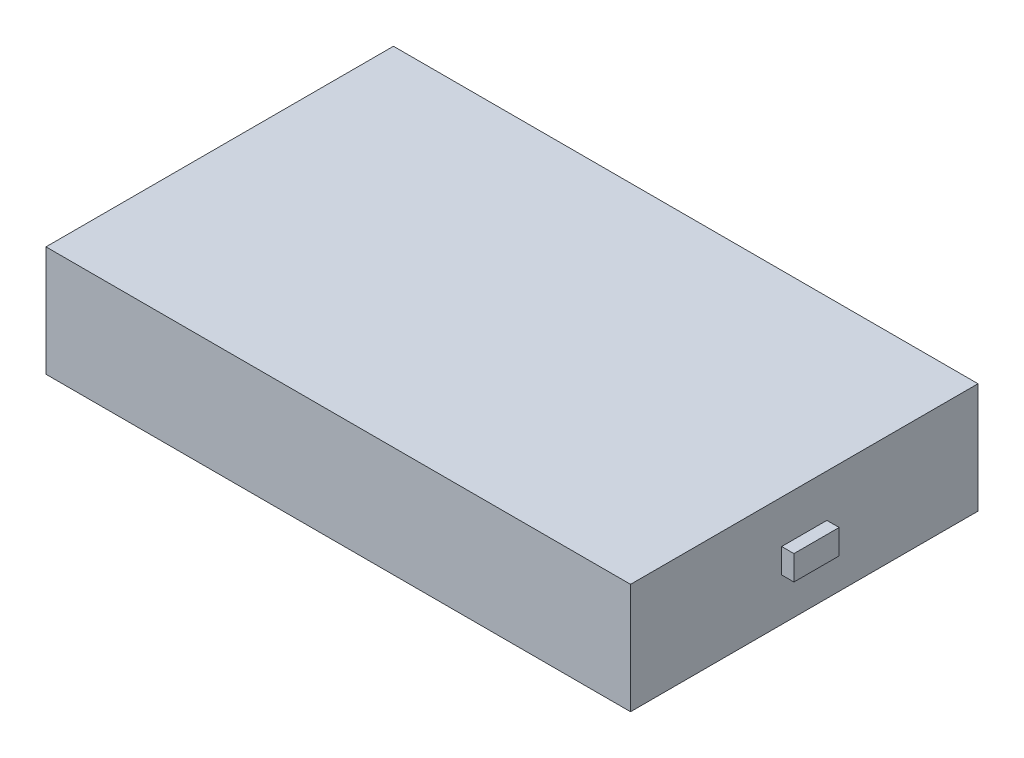
ISO-10303-21;
HEADER;
FILE_DESCRIPTION(('STEP AP214'),'2;1');
FILE_NAME('part.step','',(''),(''),'','','');
FILE_SCHEMA(('AUTOMOTIVE_DESIGN { 1 0 10303 214 1 1 1 1 }'));
ENDSEC;
DATA;
#1=APPLICATION_CONTEXT('core data for automotive mechanical design processes');
#2=APPLICATION_PROTOCOL_DEFINITION('international standard','automotive_design',2000,#1);
#3=PRODUCT_CONTEXT('',#1,'mechanical');
#4=PRODUCT('Part','Part','',(#3));
#5=PRODUCT_RELATED_PRODUCT_CATEGORY('part','',(#4));
#6=PRODUCT_DEFINITION_FORMATION('','',#4);
#7=PRODUCT_DEFINITION_CONTEXT('part definition',#1,'design');
#8=PRODUCT_DEFINITION('design','',#6,#7);
#9=PRODUCT_DEFINITION_SHAPE('','',#8);
#10=(LENGTH_UNIT() NAMED_UNIT(*) SI_UNIT(.MILLI.,.METRE.));
#11=(NAMED_UNIT(*) PLANE_ANGLE_UNIT() SI_UNIT($,.RADIAN.));
#12=(NAMED_UNIT(*) SI_UNIT($,.STERADIAN.) SOLID_ANGLE_UNIT());
#13=UNCERTAINTY_MEASURE_WITH_UNIT(LENGTH_MEASURE(1.E-05),#10,'distance_accuracy_value','');
#14=(GEOMETRIC_REPRESENTATION_CONTEXT(3) GLOBAL_UNCERTAINTY_ASSIGNED_CONTEXT((#13)) GLOBAL_UNIT_ASSIGNED_CONTEXT((#10,
#11,#12)) REPRESENTATION_CONTEXT('',''));
#15=CARTESIAN_POINT('',(0.,0.,0.));
#16=DIRECTION('',(0.,0.,1.));
#17=DIRECTION('',(1.,0.,0.));
#18=AXIS2_PLACEMENT_3D('',#15,#16,#17);
#19=CARTESIAN_POINT('',(71.5,27.,42.5));
#20=DIRECTION('',(-1.,0.,0.));
#21=DIRECTION('',(0.,0.,1.));
#22=AXIS2_PLACEMENT_3D('',#19,#20,#21);
#23=PLANE('',#22);
#24=DIRECTION('',(0.,0.,-1.));
#25=VECTOR('',#24,1.);
#26=CARTESIAN_POINT('',(71.5,0.,42.5));
#27=LINE('',#26,#25);
#28=CARTESIAN_POINT('',(71.5,0.,42.5));
#29=VERTEX_POINT('',#28);
#30=CARTESIAN_POINT('',(71.5,0.,-42.5));
#31=VERTEX_POINT('',#30);
#32=EDGE_CURVE('E160',#29,#31,#27,.T.);
#33=ORIENTED_EDGE('',*,*,#32,.T.);
#34=DIRECTION('',(0.,-1.,0.));
#35=VECTOR('',#34,1.);
#36=CARTESIAN_POINT('',(71.5,27.,-42.5));
#37=LINE('',#36,#35);
#38=CARTESIAN_POINT('',(71.5,27.,-42.5));
#39=VERTEX_POINT('',#38);
#40=EDGE_CURVE('E168',#39,#31,#37,.T.);
#41=ORIENTED_EDGE('',*,*,#40,.F.);
#42=DIRECTION('',(0.,0.,-1.));
#43=VECTOR('',#42,1.);
#44=CARTESIAN_POINT('',(71.5,27.,42.5));
#45=LINE('',#44,#43);
#46=CARTESIAN_POINT('',(71.5,27.,42.5));
#47=VERTEX_POINT('',#46);
#48=EDGE_CURVE('E151',#47,#39,#45,.T.);
#49=ORIENTED_EDGE('',*,*,#48,.F.);
#50=DIRECTION('',(0.,-1.,0.));
#51=VECTOR('',#50,1.);
#52=CARTESIAN_POINT('',(71.5,27.,42.5));
#53=LINE('',#52,#51);
#54=EDGE_CURVE('E51',#47,#29,#53,.T.);
#55=ORIENTED_EDGE('',*,*,#54,.T.);
#56=EDGE_LOOP('',(#33,#41,#49,#55));
#57=FACE_BOUND('',#56,.T.);
#58=DIRECTION('',(0.,-1.,0.));
#59=VECTOR('',#58,1.);
#60=CARTESIAN_POINT('',(71.5,10.5050818194356,5.5326037451444));
#61=LINE('',#60,#59);
#62=CARTESIAN_POINT('',(71.5,16.5294725641484,5.5326037451444));
#63=VERTEX_POINT('',#62);
#64=CARTESIAN_POINT('',(71.5,10.5050818194356,5.5326037451444));
#65=VERTEX_POINT('',#64);
#66=EDGE_CURVE('E130',#63,#65,#61,.T.);
#67=ORIENTED_EDGE('',*,*,#66,.F.);
#68=DIRECTION('',(0.,0.,1.));
#69=VECTOR('',#68,1.);
#70=CARTESIAN_POINT('',(71.5,16.5294725641484,-5.5326037451444));
#71=LINE('',#70,#69);
#72=CARTESIAN_POINT('',(71.5,16.5294725641484,-5.5326037451444));
#73=VERTEX_POINT('',#72);
#74=EDGE_CURVE('E127',#73,#63,#71,.T.);
#75=ORIENTED_EDGE('',*,*,#74,.F.);
#76=DIRECTION('',(0.,1.,0.));
#77=VECTOR('',#76,1.);
#78=CARTESIAN_POINT('',(71.5,10.5050818194356,-5.5326037451444));
#79=LINE('',#78,#77);
#80=CARTESIAN_POINT('',(71.5,10.5050818194356,-5.5326037451444));
#81=VERTEX_POINT('',#80);
#82=EDGE_CURVE('E63',#81,#73,#79,.T.);
#83=ORIENTED_EDGE('',*,*,#82,.F.);
#84=DIRECTION('',(0.,0.,-1.));
#85=VECTOR('',#84,1.);
#86=CARTESIAN_POINT('',(71.5,10.5050818194356,-5.5326037451444));
#87=LINE('',#86,#85);
#88=EDGE_CURVE('E58',#65,#81,#87,.T.);
#89=ORIENTED_EDGE('',*,*,#88,.F.);
#90=EDGE_LOOP('',(#67,#75,#83,#89));
#91=FACE_BOUND('',#90,.T.);
#92=ADVANCED_FACE('F42',(#57,#91),#23,.F.);
#93=CARTESIAN_POINT('',(-71.5,27.,42.5));
#94=DIRECTION('',(1.,0.,0.));
#95=DIRECTION('',(0.,0.,-1.));
#96=AXIS2_PLACEMENT_3D('',#93,#94,#95);
#97=PLANE('',#96);
#98=DIRECTION('',(0.,0.,1.));
#99=VECTOR('',#98,1.);
#100=CARTESIAN_POINT('',(-71.5,0.,42.5));
#101=LINE('',#100,#99);
#102=CARTESIAN_POINT('',(-71.5,0.,-42.5));
#103=VERTEX_POINT('',#102);
#104=CARTESIAN_POINT('',(-71.5,0.,42.5));
#105=VERTEX_POINT('',#104);
#106=EDGE_CURVE('E132',#103,#105,#101,.T.);
#107=ORIENTED_EDGE('',*,*,#106,.T.);
#108=DIRECTION('',(0.,-1.,0.));
#109=VECTOR('',#108,1.);
#110=CARTESIAN_POINT('',(-71.5,27.,42.5));
#111=LINE('',#110,#109);
#112=CARTESIAN_POINT('',(-71.5,27.,42.5));
#113=VERTEX_POINT('',#112);
#114=EDGE_CURVE('E11',#113,#105,#111,.T.);
#115=ORIENTED_EDGE('',*,*,#114,.F.);
#116=DIRECTION('',(0.,0.,1.));
#117=VECTOR('',#116,1.);
#118=CARTESIAN_POINT('',(-71.5,27.,42.5));
#119=LINE('',#118,#117);
#120=CARTESIAN_POINT('',(-71.5,27.,-42.5));
#121=VERTEX_POINT('',#120);
#122=EDGE_CURVE('E143',#121,#113,#119,.T.);
#123=ORIENTED_EDGE('',*,*,#122,.F.);
#124=DIRECTION('',(0.,-1.,0.));
#125=VECTOR('',#124,1.);
#126=CARTESIAN_POINT('',(-71.5,27.,-42.5));
#127=LINE('',#126,#125);
#128=EDGE_CURVE('E156',#121,#103,#127,.T.);
#129=ORIENTED_EDGE('',*,*,#128,.T.);
#130=EDGE_LOOP('',(#107,#115,#123,#129));
#131=FACE_BOUND('',#130,.T.);
#132=ADVANCED_FACE('F44',(#131),#97,.F.);
#133=CARTESIAN_POINT('',(71.5,27.,42.5));
#134=DIRECTION('',(0.,0.,-1.));
#135=DIRECTION('',(-1.,0.,0.));
#136=AXIS2_PLACEMENT_3D('',#133,#134,#135);
#137=PLANE('',#136);
#138=DIRECTION('',(1.,0.,0.));
#139=VECTOR('',#138,1.);
#140=CARTESIAN_POINT('',(71.5,0.,42.5));
#141=LINE('',#140,#139);
#142=EDGE_CURVE('E137',#105,#29,#141,.T.);
#143=ORIENTED_EDGE('',*,*,#142,.T.);
#144=ORIENTED_EDGE('',*,*,#54,.F.);
#145=DIRECTION('',(1.,0.,0.));
#146=VECTOR('',#145,1.);
#147=CARTESIAN_POINT('',(71.5,27.,42.5));
#148=LINE('',#147,#146);
#149=EDGE_CURVE('E147',#113,#47,#148,.T.);
#150=ORIENTED_EDGE('',*,*,#149,.F.);
#151=ORIENTED_EDGE('',*,*,#114,.T.);
#152=EDGE_LOOP('',(#143,#144,#150,#151));
#153=FACE_BOUND('',#152,.T.);
#154=ADVANCED_FACE('F192',(#153),#137,.F.);
#155=CARTESIAN_POINT('',(71.5,27.,-42.5));
#156=DIRECTION('',(0.,0.,1.));
#157=DIRECTION('',(1.,0.,0.));
#158=AXIS2_PLACEMENT_3D('',#155,#156,#157);
#159=PLANE('',#158);
#160=DIRECTION('',(-1.,0.,0.));
#161=VECTOR('',#160,1.);
#162=CARTESIAN_POINT('',(71.5,0.,-42.5));
#163=LINE('',#162,#161);
#164=EDGE_CURVE('E148',#31,#103,#163,.T.);
#165=ORIENTED_EDGE('',*,*,#164,.T.);
#166=ORIENTED_EDGE('',*,*,#128,.F.);
#167=DIRECTION('',(-1.,0.,0.));
#168=VECTOR('',#167,1.);
#169=CARTESIAN_POINT('',(71.5,27.,-42.5));
#170=LINE('',#169,#168);
#171=EDGE_CURVE('E154',#39,#121,#170,.T.);
#172=ORIENTED_EDGE('',*,*,#171,.F.);
#173=ORIENTED_EDGE('',*,*,#40,.T.);
#174=EDGE_LOOP('',(#165,#166,#172,#173));
#175=FACE_BOUND('',#174,.T.);
#176=ADVANCED_FACE('F185',(#175),#159,.F.);
#177=CARTESIAN_POINT('',(0.,27.,0.));
#178=DIRECTION('',(0.,1.,0.));
#179=DIRECTION('',(0.,0.,1.));
#180=AXIS2_PLACEMENT_3D('',#177,#178,#179);
#181=PLANE('',#180);
#182=ORIENTED_EDGE('',*,*,#122,.T.);
#183=ORIENTED_EDGE('',*,*,#149,.T.);
#184=ORIENTED_EDGE('',*,*,#48,.T.);
#185=ORIENTED_EDGE('',*,*,#171,.T.);
#186=EDGE_LOOP('',(#182,#183,#184,#185));
#187=FACE_BOUND('',#186,.T.);
#188=ADVANCED_FACE('F191',(#187),#181,.T.);
#189=CARTESIAN_POINT('',(0.,0.,0.));
#190=DIRECTION('',(0.,1.,0.));
#191=DIRECTION('',(0.,0.,1.));
#192=AXIS2_PLACEMENT_3D('',#189,#190,#191);
#193=PLANE('',#192);
#194=ORIENTED_EDGE('',*,*,#106,.F.);
#195=ORIENTED_EDGE('',*,*,#164,.F.);
#196=ORIENTED_EDGE('',*,*,#32,.F.);
#197=ORIENTED_EDGE('',*,*,#142,.F.);
#198=EDGE_LOOP('',(#194,#195,#196,#197));
#199=FACE_BOUND('',#198,.T.);
#200=ADVANCED_FACE('F182',(#199),#193,.F.);
#201=CARTESIAN_POINT('',(74.5,10.5050818194356,5.5326037451444));
#202=DIRECTION('',(0.,0.,-1.));
#203=DIRECTION('',(-1.,0.,0.));
#204=AXIS2_PLACEMENT_3D('',#201,#202,#203);
#205=PLANE('',#204);
#206=ORIENTED_EDGE('',*,*,#66,.T.);
#207=DIRECTION('',(-1.,0.,0.));
#208=VECTOR('',#207,1.);
#209=CARTESIAN_POINT('',(74.5,10.5050818194356,5.5326037451444));
#210=LINE('',#209,#208);
#211=CARTESIAN_POINT('',(74.5,10.5050818194356,5.5326037451444));
#212=VERTEX_POINT('',#211);
#213=EDGE_CURVE('E109',#212,#65,#210,.T.);
#214=ORIENTED_EDGE('',*,*,#213,.F.);
#215=DIRECTION('',(0.,-1.,0.));
#216=VECTOR('',#215,1.);
#217=CARTESIAN_POINT('',(74.5,10.5050818194356,5.5326037451444));
#218=LINE('',#217,#216);
#219=CARTESIAN_POINT('',(74.5,16.5294725641484,5.5326037451444));
#220=VERTEX_POINT('',#219);
#221=EDGE_CURVE('E117',#220,#212,#218,.T.);
#222=ORIENTED_EDGE('',*,*,#221,.F.);
#223=DIRECTION('',(-1.,0.,0.));
#224=VECTOR('',#223,1.);
#225=CARTESIAN_POINT('',(74.5,16.5294725641484,5.5326037451444));
#226=LINE('',#225,#224);
#227=EDGE_CURVE('E307',#220,#63,#226,.T.);
#228=ORIENTED_EDGE('',*,*,#227,.T.);
#229=EDGE_LOOP('',(#206,#214,#222,#228));
#230=FACE_BOUND('',#229,.T.);
#231=ADVANCED_FACE('F129',(#230),#205,.F.);
#232=CARTESIAN_POINT('',(74.5,10.5050818194356,-5.5326037451444));
#233=DIRECTION('',(0.,1.,0.));
#234=DIRECTION('',(0.,0.,1.));
#235=AXIS2_PLACEMENT_3D('',#232,#233,#234);
#236=PLANE('',#235);
#237=ORIENTED_EDGE('',*,*,#88,.T.);
#238=DIRECTION('',(-1.,0.,0.));
#239=VECTOR('',#238,1.);
#240=CARTESIAN_POINT('',(74.5,10.5050818194356,-5.5326037451444));
#241=LINE('',#240,#239);
#242=CARTESIAN_POINT('',(74.5,10.5050818194356,-5.5326037451444));
#243=VERTEX_POINT('',#242);
#244=EDGE_CURVE('E112',#243,#81,#241,.T.);
#245=ORIENTED_EDGE('',*,*,#244,.F.);
#246=DIRECTION('',(0.,0.,-1.));
#247=VECTOR('',#246,1.);
#248=CARTESIAN_POINT('',(74.5,10.5050818194356,-5.5326037451444));
#249=LINE('',#248,#247);
#250=EDGE_CURVE('E105',#212,#243,#249,.T.);
#251=ORIENTED_EDGE('',*,*,#250,.F.);
#252=ORIENTED_EDGE('',*,*,#213,.T.);
#253=EDGE_LOOP('',(#237,#245,#251,#252));
#254=FACE_BOUND('',#253,.T.);
#255=ADVANCED_FACE('F107',(#254),#236,.F.);
#256=CARTESIAN_POINT('',(74.5,10.5050818194356,-5.5326037451444));
#257=DIRECTION('',(0.,0.,1.));
#258=DIRECTION('',(1.,0.,0.));
#259=AXIS2_PLACEMENT_3D('',#256,#257,#258);
#260=PLANE('',#259);
#261=ORIENTED_EDGE('',*,*,#82,.T.);
#262=DIRECTION('',(-1.,0.,0.));
#263=VECTOR('',#262,1.);
#264=CARTESIAN_POINT('',(74.5,16.5294725641484,-5.5326037451444));
#265=LINE('',#264,#263);
#266=CARTESIAN_POINT('',(74.5,16.5294725641484,-5.5326037451444));
#267=VERTEX_POINT('',#266);
#268=EDGE_CURVE('E139',#267,#73,#265,.T.);
#269=ORIENTED_EDGE('',*,*,#268,.F.);
#270=DIRECTION('',(0.,1.,0.));
#271=VECTOR('',#270,1.);
#272=CARTESIAN_POINT('',(74.5,10.5050818194356,-5.5326037451444));
#273=LINE('',#272,#271);
#274=EDGE_CURVE('E116',#243,#267,#273,.T.);
#275=ORIENTED_EDGE('',*,*,#274,.F.);
#276=ORIENTED_EDGE('',*,*,#244,.T.);
#277=EDGE_LOOP('',(#261,#269,#275,#276));
#278=FACE_BOUND('',#277,.T.);
#279=ADVANCED_FACE('F212',(#278),#260,.F.);
#280=CARTESIAN_POINT('',(74.5,16.5294725641484,-5.5326037451444));
#281=DIRECTION('',(0.,-1.,0.));
#282=DIRECTION('',(0.,0.,-1.));
#283=AXIS2_PLACEMENT_3D('',#280,#281,#282);
#284=PLANE('',#283);
#285=ORIENTED_EDGE('',*,*,#74,.T.);
#286=ORIENTED_EDGE('',*,*,#227,.F.);
#287=DIRECTION('',(0.,0.,1.));
#288=VECTOR('',#287,1.);
#289=CARTESIAN_POINT('',(74.5,16.5294725641484,-5.5326037451444));
#290=LINE('',#289,#288);
#291=EDGE_CURVE('E122',#267,#220,#290,.T.);
#292=ORIENTED_EDGE('',*,*,#291,.F.);
#293=ORIENTED_EDGE('',*,*,#268,.T.);
#294=EDGE_LOOP('',(#285,#286,#292,#293));
#295=FACE_BOUND('',#294,.T.);
#296=ADVANCED_FACE('F215',(#295),#284,.F.);
#297=CARTESIAN_POINT('',(74.5,0.,0.));
#298=DIRECTION('',(1.,0.,0.));
#299=DIRECTION('',(0.,0.,-1.));
#300=AXIS2_PLACEMENT_3D('',#297,#298,#299);
#301=PLANE('',#300);
#302=ORIENTED_EDGE('',*,*,#221,.T.);
#303=ORIENTED_EDGE('',*,*,#250,.T.);
#304=ORIENTED_EDGE('',*,*,#274,.T.);
#305=ORIENTED_EDGE('',*,*,#291,.T.);
#306=EDGE_LOOP('',(#302,#303,#304,#305));
#307=FACE_BOUND('',#306,.T.);
#308=ADVANCED_FACE('F120',(#307),#301,.T.);
#309=CLOSED_SHELL('',(#92,#132,#154,#176,#188,#200,#231,#255,#279,#296,#308));
#310=MANIFOLD_SOLID_BREP('B2',#309);
#311=ADVANCED_BREP_SHAPE_REPRESENTATION('',(#18,#310),#14);
#312=SHAPE_DEFINITION_REPRESENTATION(#9,#311);
ENDSEC;
END-ISO-10303-21;
